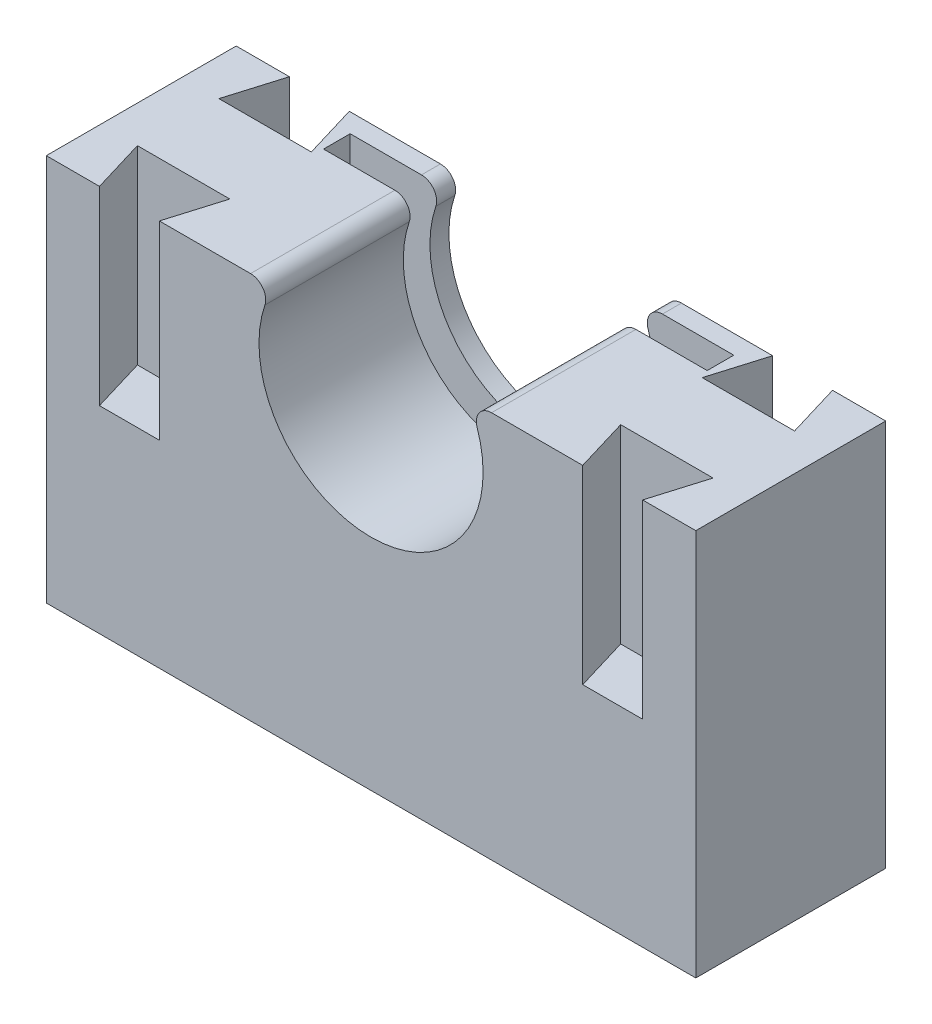
ISO-10303-21;
HEADER;
FILE_DESCRIPTION(('STEP AP214'),'2;1');
FILE_NAME('part.step','',(''),(''),'','','');
FILE_SCHEMA(('AUTOMOTIVE_DESIGN { 1 0 10303 214 1 1 1 1 }'));
ENDSEC;
DATA;
#1=APPLICATION_CONTEXT('core data for automotive mechanical design processes');
#2=APPLICATION_PROTOCOL_DEFINITION('international standard','automotive_design',2000,#1);
#3=PRODUCT_CONTEXT('',#1,'mechanical');
#4=PRODUCT('Part','Part','',(#3));
#5=PRODUCT_RELATED_PRODUCT_CATEGORY('part','',(#4));
#6=PRODUCT_DEFINITION_FORMATION('','',#4);
#7=PRODUCT_DEFINITION_CONTEXT('part definition',#1,'design');
#8=PRODUCT_DEFINITION('design','',#6,#7);
#9=PRODUCT_DEFINITION_SHAPE('','',#8);
#10=(LENGTH_UNIT() NAMED_UNIT(*) SI_UNIT(.MILLI.,.METRE.));
#11=(NAMED_UNIT(*) PLANE_ANGLE_UNIT() SI_UNIT($,.RADIAN.));
#12=(NAMED_UNIT(*) SI_UNIT($,.STERADIAN.) SOLID_ANGLE_UNIT());
#13=UNCERTAINTY_MEASURE_WITH_UNIT(LENGTH_MEASURE(1.E-05),#10,'distance_accuracy_value','');
#14=(GEOMETRIC_REPRESENTATION_CONTEXT(3) GLOBAL_UNCERTAINTY_ASSIGNED_CONTEXT((#13)) GLOBAL_UNIT_ASSIGNED_CONTEXT((#10,
#11,#12)) REPRESENTATION_CONTEXT('',''));
#15=CARTESIAN_POINT('',(0.,0.,0.));
#16=DIRECTION('',(0.,0.,1.));
#17=DIRECTION('',(1.,0.,0.));
#18=AXIS2_PLACEMENT_3D('',#15,#16,#17);
#19=CARTESIAN_POINT('',(27.0146670463276,26.0149253731343,25.));
#20=DIRECTION('',(0.,0.,-1.));
#21=DIRECTION('',(-1.,0.,0.));
#22=AXIS2_PLACEMENT_3D('',#19,#20,#21);
#23=CYLINDRICAL_SURFACE('',#22,2.);
#24=CARTESIAN_POINT('',(27.0146670463276,26.0149253731343,2.5));
#25=DIRECTION('',(0.,0.,1.));
#26=DIRECTION('',(1.,0.,0.));
#27=AXIS2_PLACEMENT_3D('',#24,#25,#26);
#28=CIRCLE('',#27,2.);
#29=CARTESIAN_POINT('',(27.0146670463276,28.0149253731343,2.5));
#30=VERTEX_POINT('',#29);
#31=CARTESIAN_POINT('',(25.1204378482512,25.3731343283582,2.5));
#32=VERTEX_POINT('',#31);
#33=EDGE_CURVE('E296',#30,#32,#28,.T.);
#34=ORIENTED_EDGE('',*,*,#33,.F.);
#35=DIRECTION('',(0.,0.,-1.));
#36=VECTOR('',#35,1.);
#37=CARTESIAN_POINT('',(27.0146670463276,28.0149253731343,25.));
#38=LINE('',#37,#36);
#39=CARTESIAN_POINT('',(27.0146670463276,28.0149253731343,0.));
#40=VERTEX_POINT('',#39);
#41=EDGE_CURVE('E549',#30,#40,#38,.T.);
#42=ORIENTED_EDGE('',*,*,#41,.T.);
#43=CARTESIAN_POINT('',(27.0146670463276,26.0149253731343,0.));
#44=DIRECTION('',(0.,0.,1.));
#45=DIRECTION('',(1.,0.,0.));
#46=AXIS2_PLACEMENT_3D('',#43,#44,#45);
#47=CIRCLE('',#46,2.);
#48=CARTESIAN_POINT('',(25.1204378482512,25.3731343283582,0.));
#49=VERTEX_POINT('',#48);
#50=EDGE_CURVE('E501',#40,#49,#47,.T.);
#51=ORIENTED_EDGE('',*,*,#50,.T.);
#52=DIRECTION('',(0.,0.,-1.));
#53=VECTOR('',#52,1.);
#54=CARTESIAN_POINT('',(25.1204378482512,25.3731343283582,25.));
#55=LINE('',#54,#53);
#56=EDGE_CURVE('E544',#32,#49,#55,.T.);
#57=ORIENTED_EDGE('',*,*,#56,.F.);
#58=EDGE_LOOP('',(#34,#42,#51,#57));
#59=FACE_BOUND('',#58,.T.);
#60=ADVANCED_FACE('F44',(#59),#23,.T.);
#61=CARTESIAN_POINT('',(11.1504975124378,20.6399253731341,25.));
#62=DIRECTION('',(0.,0.,-1.));
#63=DIRECTION('',(-1.,0.,0.));
#64=AXIS2_PLACEMENT_3D('',#61,#62,#63);
#65=CYLINDRICAL_SURFACE('',#64,14.75);
#66=CARTESIAN_POINT('',(11.1504975124378,20.6399253731341,2.5));
#67=DIRECTION('',(0.,0.,1.));
#68=DIRECTION('',(1.,0.,0.));
#69=AXIS2_PLACEMENT_3D('',#66,#67,#68);
#70=CIRCLE('',#69,14.75);
#71=CARTESIAN_POINT('',(-2.81944282337562,25.3731343283582,2.5));
#72=VERTEX_POINT('',#71);
#73=EDGE_CURVE('E60',#32,#72,#70,.F.);
#74=ORIENTED_EDGE('',*,*,#73,.F.);
#75=ORIENTED_EDGE('',*,*,#56,.T.);
#76=CARTESIAN_POINT('',(11.1504975124378,20.6399253731341,0.));
#77=DIRECTION('',(0.,0.,-1.));
#78=DIRECTION('',(1.,0.,0.));
#79=AXIS2_PLACEMENT_3D('',#76,#77,#78);
#80=CIRCLE('',#79,14.75);
#81=CARTESIAN_POINT('',(-2.81944282337562,25.3731343283582,0.));
#82=VERTEX_POINT('',#81);
#83=EDGE_CURVE('E505',#49,#82,#80,.T.);
#84=ORIENTED_EDGE('',*,*,#83,.T.);
#85=DIRECTION('',(0.,0.,-1.));
#86=VECTOR('',#85,1.);
#87=CARTESIAN_POINT('',(-2.81944282337562,25.3731343283582,25.));
#88=LINE('',#87,#86);
#89=EDGE_CURVE('E539',#72,#82,#88,.T.);
#90=ORIENTED_EDGE('',*,*,#89,.F.);
#91=EDGE_LOOP('',(#74,#75,#84,#90));
#92=FACE_BOUND('',#91,.T.);
#93=ADVANCED_FACE('F672',(#92),#65,.F.);
#94=CARTESIAN_POINT('',(-4.71367202145201,26.0149253731343,25.));
#95=DIRECTION('',(0.,0.,-1.));
#96=DIRECTION('',(-1.,0.,0.));
#97=AXIS2_PLACEMENT_3D('',#94,#95,#96);
#98=CYLINDRICAL_SURFACE('',#97,2.);
#99=CARTESIAN_POINT('',(-4.71367202145201,26.0149253731343,2.5));
#100=DIRECTION('',(0.,0.,1.));
#101=DIRECTION('',(1.,0.,0.));
#102=AXIS2_PLACEMENT_3D('',#99,#100,#101);
#103=CIRCLE('',#102,2.);
#104=CARTESIAN_POINT('',(-4.71367202145201,28.0149253731343,2.5));
#105=VERTEX_POINT('',#104);
#106=EDGE_CURVE('E53',#72,#105,#103,.T.);
#107=ORIENTED_EDGE('',*,*,#106,.F.);
#108=ORIENTED_EDGE('',*,*,#89,.T.);
#109=CARTESIAN_POINT('',(-4.71367202145201,26.0149253731343,0.));
#110=DIRECTION('',(0.,0.,1.));
#111=DIRECTION('',(-1.,0.,0.));
#112=AXIS2_PLACEMENT_3D('',#109,#110,#111);
#113=CIRCLE('',#112,2.);
#114=CARTESIAN_POINT('',(-4.71367202145201,28.0149253731343,0.));
#115=VERTEX_POINT('',#114);
#116=EDGE_CURVE('E509',#82,#115,#113,.T.);
#117=ORIENTED_EDGE('',*,*,#116,.T.);
#118=DIRECTION('',(0.,0.,-1.));
#119=VECTOR('',#118,1.);
#120=CARTESIAN_POINT('',(-4.71367202145201,28.0149253731343,25.));
#121=LINE('',#120,#119);
#122=EDGE_CURVE('E534',#105,#115,#121,.T.);
#123=ORIENTED_EDGE('',*,*,#122,.F.);
#124=EDGE_LOOP('',(#107,#108,#117,#123));
#125=FACE_BOUND('',#124,.T.);
#126=ADVANCED_FACE('F577',(#125),#98,.T.);
#127=CARTESIAN_POINT('',(53.9004975124378,28.0149253731343,25.));
#128=DIRECTION('',(0.,-1.,0.));
#129=DIRECTION('',(1.,0.,0.));
#130=AXIS2_PLACEMENT_3D('',#127,#128,#129);
#131=PLANE('',#130);
#132=DIRECTION('',(0.,0.,-1.));
#133=VECTOR('',#132,1.);
#134=CARTESIAN_POINT('',(36.4004975124378,28.0149253731343,6.));
#135=LINE('',#134,#133);
#136=CARTESIAN_POINT('',(36.4004975124378,28.0149253731343,6.));
#137=VERTEX_POINT('',#136);
#138=CARTESIAN_POINT('',(36.4004975124378,28.0149253731343,2.5));
#139=VERTEX_POINT('',#138);
#140=EDGE_CURVE('E272',#137,#139,#135,.T.);
#141=ORIENTED_EDGE('',*,*,#140,.F.);
#142=DIRECTION('',(1.,0.,0.));
#143=VECTOR('',#142,1.);
#144=CARTESIAN_POINT('',(36.4004975124378,28.0149253731343,6.));
#145=LINE('',#144,#143);
#146=CARTESIAN_POINT('',(27.0146670463276,28.0149253731343,6.));
#147=VERTEX_POINT('',#146);
#148=EDGE_CURVE('E254',#147,#137,#145,.T.);
#149=ORIENTED_EDGE('',*,*,#148,.F.);
#150=CARTESIAN_POINT('',(27.0146670463276,28.0149253731343,25.));
#151=VERTEX_POINT('',#150);
#152=EDGE_CURVE('E550',#151,#147,#38,.T.);
#153=ORIENTED_EDGE('',*,*,#152,.F.);
#154=DIRECTION('',(-1.,0.,0.));
#155=VECTOR('',#154,1.);
#156=CARTESIAN_POINT('',(53.9004975124378,28.0149253731343,25.));
#157=LINE('',#156,#155);
#158=CARTESIAN_POINT('',(39.0146670463276,28.0149253731343,25.));
#159=VERTEX_POINT('',#158);
#160=EDGE_CURVE('E467',#159,#151,#157,.T.);
#161=ORIENTED_EDGE('',*,*,#160,.F.);
#162=DIRECTION('',(-0.287193343911959,0.,-0.957872634128707));
#163=VECTOR('',#162,1.);
#164=CARTESIAN_POINT('',(39.0146670463276,28.0149253731343,25.));
#165=LINE('',#164,#163);
#166=CARTESIAN_POINT('',(36.8750766341835,28.0149253731343,17.8638488757411));
#167=VERTEX_POINT('',#166);
#168=EDGE_CURVE('E366',#159,#167,#165,.T.);
#169=ORIENTED_EDGE('',*,*,#168,.T.);
#170=DIRECTION('',(1.,0.,0.));
#171=VECTOR('',#170,1.);
#172=CARTESIAN_POINT('',(36.8750766341835,28.0149253731343,17.8638488757411));
#173=LINE('',#172,#171);
#174=CARTESIAN_POINT('',(49.0400879245819,28.0149253731343,17.8638488757411));
#175=VERTEX_POINT('',#174);
#176=EDGE_CURVE('E370',#167,#175,#173,.T.);
#177=ORIENTED_EDGE('',*,*,#176,.T.);
#178=DIRECTION('',(-0.287193343911958,0.,0.957872634128707));
#179=VECTOR('',#178,1.);
#180=CARTESIAN_POINT('',(49.0400879245819,28.0149253731343,17.8638488757411));
#181=LINE('',#180,#179);
#182=CARTESIAN_POINT('',(46.9004975124378,28.0149253731343,25.));
#183=VERTEX_POINT('',#182);
#184=EDGE_CURVE('E374',#175,#183,#181,.T.);
#185=ORIENTED_EDGE('',*,*,#184,.T.);
#186=CARTESIAN_POINT('',(53.9004975124378,28.0149253731343,25.));
#187=VERTEX_POINT('',#186);
#188=EDGE_CURVE('E469',#187,#183,#157,.T.);
#189=ORIENTED_EDGE('',*,*,#188,.F.);
#190=DIRECTION('',(0.,0.,-1.));
#191=VECTOR('',#190,1.);
#192=CARTESIAN_POINT('',(53.9004975124378,28.0149253731343,25.));
#193=LINE('',#192,#191);
#194=CARTESIAN_POINT('',(53.9004975124378,28.0149253731343,0.));
#195=VERTEX_POINT('',#194);
#196=EDGE_CURVE('E553',#187,#195,#193,.T.);
#197=ORIENTED_EDGE('',*,*,#196,.T.);
#198=DIRECTION('',(-1.,0.,0.));
#199=VECTOR('',#198,1.);
#200=CARTESIAN_POINT('',(53.9004975124378,28.0149253731343,0.));
#201=LINE('',#200,#199);
#202=CARTESIAN_POINT('',(46.9004975124378,28.0149253731343,0.));
#203=VERTEX_POINT('',#202);
#204=EDGE_CURVE('E497',#195,#203,#201,.T.);
#205=ORIENTED_EDGE('',*,*,#204,.T.);
#206=DIRECTION('',(0.287193343911966,0.,0.957872634128704));
#207=VECTOR('',#206,1.);
#208=CARTESIAN_POINT('',(46.9004975124378,28.0149253731343,0.));
#209=LINE('',#208,#207);
#210=CARTESIAN_POINT('',(49.040087924582,28.0149253731343,7.13615112425885));
#211=VERTEX_POINT('',#210);
#212=EDGE_CURVE('E378',#203,#211,#209,.T.);
#213=ORIENTED_EDGE('',*,*,#212,.T.);
#214=DIRECTION('',(-1.,0.,0.));
#215=VECTOR('',#214,1.);
#216=CARTESIAN_POINT('',(49.040087924582,28.0149253731343,7.13615112425885));
#217=LINE('',#216,#215);
#218=CARTESIAN_POINT('',(36.8750766341835,28.0149253731343,7.13615112425885));
#219=VERTEX_POINT('',#218);
#220=EDGE_CURVE('E382',#211,#219,#217,.T.);
#221=ORIENTED_EDGE('',*,*,#220,.T.);
#222=DIRECTION('',(0.287193343911964,0.,-0.957872634128705));
#223=VECTOR('',#222,1.);
#224=CARTESIAN_POINT('',(36.8750766341835,28.0149253731343,7.13615112425885));
#225=LINE('',#224,#223);
#226=CARTESIAN_POINT('',(39.0146670463276,28.0149253731343,0.));
#227=VERTEX_POINT('',#226);
#228=EDGE_CURVE('E386',#219,#227,#225,.T.);
#229=ORIENTED_EDGE('',*,*,#228,.T.);
#230=EDGE_CURVE('E496',#227,#40,#201,.T.);
#231=ORIENTED_EDGE('',*,*,#230,.T.);
#232=ORIENTED_EDGE('',*,*,#41,.F.);
#233=DIRECTION('',(1.,0.,0.));
#234=VECTOR('',#233,1.);
#235=CARTESIAN_POINT('',(36.4004975124378,28.0149253731343,2.5));
#236=LINE('',#235,#234);
#237=EDGE_CURVE('E282',#30,#139,#236,.T.);
#238=ORIENTED_EDGE('',*,*,#237,.T.);
#239=EDGE_LOOP('',(#141,#149,#153,#161,#169,#177,#185,#189,#197,#205,#213,#221,#229,#231,#232,#238));
#240=FACE_BOUND('',#239,.T.);
#241=ADVANCED_FACE('F280',(#240),#131,.F.);
#242=CARTESIAN_POINT('',(-4.71367202145201,28.0149253731343,25.));
#243=DIRECTION('',(0.,-1.,0.));
#244=DIRECTION('',(1.,0.,0.));
#245=AXIS2_PLACEMENT_3D('',#242,#243,#244);
#246=PLANE('',#245);
#247=CARTESIAN_POINT('',(-4.71367202145201,28.0149253731343,25.));
#248=VERTEX_POINT('',#247);
#249=CARTESIAN_POINT('',(-4.71367202145201,28.0149253731343,6.));
#250=VERTEX_POINT('',#249);
#251=EDGE_CURVE('E535',#248,#250,#121,.T.);
#252=ORIENTED_EDGE('',*,*,#251,.T.);
#253=CARTESIAN_POINT('',(-14.0995024875622,28.0149253731343,6.));
#254=VERTEX_POINT('',#253);
#255=EDGE_CURVE('E266',#254,#250,#145,.T.);
#256=ORIENTED_EDGE('',*,*,#255,.F.);
#257=DIRECTION('',(0.,0.,-1.));
#258=VECTOR('',#257,1.);
#259=CARTESIAN_POINT('',(-14.0995024875622,28.0149253731343,6.));
#260=LINE('',#259,#258);
#261=CARTESIAN_POINT('',(-14.0995024875622,28.0149253731343,2.5));
#262=VERTEX_POINT('',#261);
#263=EDGE_CURVE('E297',#254,#262,#260,.T.);
#264=ORIENTED_EDGE('',*,*,#263,.T.);
#265=EDGE_CURVE('E565',#262,#105,#236,.T.);
#266=ORIENTED_EDGE('',*,*,#265,.T.);
#267=ORIENTED_EDGE('',*,*,#122,.T.);
#268=DIRECTION('',(-1.,0.,0.));
#269=VECTOR('',#268,1.);
#270=CARTESIAN_POINT('',(-4.71367202145201,28.0149253731343,0.));
#271=LINE('',#270,#269);
#272=CARTESIAN_POINT('',(-16.713672021452,28.0149253731343,0.));
#273=VERTEX_POINT('',#272);
#274=EDGE_CURVE('E514',#115,#273,#271,.T.);
#275=ORIENTED_EDGE('',*,*,#274,.T.);
#276=DIRECTION('',(0.287115798996212,0.,0.95789588054588));
#277=VECTOR('',#276,1.);
#278=CARTESIAN_POINT('',(-14.5746593189302,28.0149253731343,7.13632431006681));
#279=LINE('',#278,#277);
#280=CARTESIAN_POINT('',(-14.5746593189302,28.0149253731343,7.13632431006681));
#281=VERTEX_POINT('',#280);
#282=EDGE_CURVE('E390',#273,#281,#279,.T.);
#283=ORIENTED_EDGE('',*,*,#282,.T.);
#284=DIRECTION('',(-1.,0.,0.));
#285=VECTOR('',#284,1.);
#286=CARTESIAN_POINT('',(-26.738515190084,28.0149253731343,7.13632431006681));
#287=LINE('',#286,#285);
#288=CARTESIAN_POINT('',(-26.738515190084,28.0149253731343,7.13632431006681));
#289=VERTEX_POINT('',#288);
#290=EDGE_CURVE('E394',#281,#289,#287,.T.);
#291=ORIENTED_EDGE('',*,*,#290,.T.);
#292=DIRECTION('',(0.287115798996211,0.,-0.95789588054588));
#293=VECTOR('',#292,1.);
#294=CARTESIAN_POINT('',(-24.5995024875622,28.0149253731343,0.));
#295=LINE('',#294,#293);
#296=CARTESIAN_POINT('',(-24.5995024875622,28.0149253731343,0.));
#297=VERTEX_POINT('',#296);
#298=EDGE_CURVE('E311',#289,#297,#295,.T.);
#299=ORIENTED_EDGE('',*,*,#298,.T.);
#300=CARTESIAN_POINT('',(-31.5995024875622,28.0149253731343,0.));
#301=VERTEX_POINT('',#300);
#302=EDGE_CURVE('E513',#297,#301,#271,.T.);
#303=ORIENTED_EDGE('',*,*,#302,.T.);
#304=DIRECTION('',(0.,0.,-1.));
#305=VECTOR('',#304,1.);
#306=CARTESIAN_POINT('',(-31.5995024875622,28.0149253731343,25.));
#307=LINE('',#306,#305);
#308=CARTESIAN_POINT('',(-31.5995024875622,28.0149253731343,25.));
#309=VERTEX_POINT('',#308);
#310=EDGE_CURVE('E530',#309,#301,#307,.T.);
#311=ORIENTED_EDGE('',*,*,#310,.F.);
#312=DIRECTION('',(-1.,0.,0.));
#313=VECTOR('',#312,1.);
#314=CARTESIAN_POINT('',(-4.71367202145201,28.0149253731343,25.));
#315=LINE('',#314,#313);
#316=CARTESIAN_POINT('',(-24.5995024875622,28.0149253731343,25.));
#317=VERTEX_POINT('',#316);
#318=EDGE_CURVE('E482',#317,#309,#315,.T.);
#319=ORIENTED_EDGE('',*,*,#318,.F.);
#320=DIRECTION('',(-0.28719334391196,0.,-0.957872634128706));
#321=VECTOR('',#320,1.);
#322=CARTESIAN_POINT('',(-24.5995024875622,28.0149253731343,25.));
#323=LINE('',#322,#321);
#324=CARTESIAN_POINT('',(-26.7390928997063,28.0149253731343,17.8638488757411));
#325=VERTEX_POINT('',#324);
#326=EDGE_CURVE('E68',#317,#325,#323,.T.);
#327=ORIENTED_EDGE('',*,*,#326,.T.);
#328=DIRECTION('',(1.,0.,0.));
#329=VECTOR('',#328,1.);
#330=CARTESIAN_POINT('',(-26.7390928997063,28.0149253731343,17.8638488757411));
#331=LINE('',#330,#329);
#332=CARTESIAN_POINT('',(-14.5740816093079,28.0149253731343,17.8638488757411));
#333=VERTEX_POINT('',#332);
#334=EDGE_CURVE('E358',#325,#333,#331,.T.);
#335=ORIENTED_EDGE('',*,*,#334,.T.);
#336=DIRECTION('',(-0.287193343911959,0.,0.957872634128707));
#337=VECTOR('',#336,1.);
#338=CARTESIAN_POINT('',(-14.5740816093079,28.0149253731343,17.8638488757411));
#339=LINE('',#338,#337);
#340=CARTESIAN_POINT('',(-16.713672021452,28.0149253731343,25.));
#341=VERTEX_POINT('',#340);
#342=EDGE_CURVE('E362',#333,#341,#339,.T.);
#343=ORIENTED_EDGE('',*,*,#342,.T.);
#344=EDGE_CURVE('E483',#248,#341,#315,.T.);
#345=ORIENTED_EDGE('',*,*,#344,.F.);
#346=EDGE_LOOP('',(#252,#256,#264,#266,#267,#275,#283,#291,#299,#303,#311,#319,#327,#335,#343,#345));
#347=FACE_BOUND('',#346,.T.);
#348=ADVANCED_FACE('F572',(#347),#246,.F.);
#349=CARTESIAN_POINT('',(-4.71367202145201,26.0149253731343,25.));
#350=DIRECTION('',(0.,0.,-1.));
#351=DIRECTION('',(-1.,0.,0.));
#352=AXIS2_PLACEMENT_3D('',#349,#350,#351);
#353=PLANE('',#352);
#354=DIRECTION('',(0.,1.,0.));
#355=VECTOR('',#354,1.);
#356=CARTESIAN_POINT('',(46.9004975124378,3.01492537313434,25.));
#357=LINE('',#356,#355);
#358=CARTESIAN_POINT('',(46.9004975124378,3.01492537313434,25.));
#359=VERTEX_POINT('',#358);
#360=EDGE_CURVE('E428',#359,#183,#357,.T.);
#361=ORIENTED_EDGE('',*,*,#360,.F.);
#362=DIRECTION('',(1.,0.,0.));
#363=VECTOR('',#362,1.);
#364=CARTESIAN_POINT('',(-4.71367202145201,3.01492537313433,25.));
#365=LINE('',#364,#363);
#366=CARTESIAN_POINT('',(39.0146670463276,3.01492537313434,25.));
#367=VERTEX_POINT('',#366);
#368=EDGE_CURVE('E404',#367,#359,#365,.T.);
#369=ORIENTED_EDGE('',*,*,#368,.F.);
#370=DIRECTION('',(0.,1.,0.));
#371=VECTOR('',#370,1.);
#372=CARTESIAN_POINT('',(39.0146670463276,3.01492537313434,25.));
#373=LINE('',#372,#371);
#374=EDGE_CURVE('E437',#367,#159,#373,.T.);
#375=ORIENTED_EDGE('',*,*,#374,.T.);
#376=ORIENTED_EDGE('',*,*,#160,.T.);
#377=CARTESIAN_POINT('',(27.0146670463276,26.0149253731343,25.));
#378=DIRECTION('',(0.,0.,1.));
#379=DIRECTION('',(1.,0.,0.));
#380=AXIS2_PLACEMENT_3D('',#377,#378,#379);
#381=CIRCLE('',#380,2.);
#382=CARTESIAN_POINT('',(25.1204378482512,25.3731343283582,25.));
#383=VERTEX_POINT('',#382);
#384=EDGE_CURVE('E473',#151,#383,#381,.T.);
#385=ORIENTED_EDGE('',*,*,#384,.T.);
#386=CARTESIAN_POINT('',(11.1504975124378,20.6399253731341,25.));
#387=DIRECTION('',(0.,0.,-1.));
#388=DIRECTION('',(1.,0.,0.));
#389=AXIS2_PLACEMENT_3D('',#386,#387,#388);
#390=CIRCLE('',#389,14.75);
#391=CARTESIAN_POINT('',(-2.81944282337562,25.3731343283582,25.));
#392=VERTEX_POINT('',#391);
#393=EDGE_CURVE('E476',#383,#392,#390,.T.);
#394=ORIENTED_EDGE('',*,*,#393,.T.);
#395=CARTESIAN_POINT('',(-4.71367202145201,26.0149253731343,25.));
#396=DIRECTION('',(0.,0.,1.));
#397=DIRECTION('',(-1.,0.,0.));
#398=AXIS2_PLACEMENT_3D('',#395,#396,#397);
#399=CIRCLE('',#398,2.);
#400=EDGE_CURVE('E479',#392,#248,#399,.T.);
#401=ORIENTED_EDGE('',*,*,#400,.T.);
#402=ORIENTED_EDGE('',*,*,#344,.T.);
#403=DIRECTION('',(0.,1.,0.));
#404=VECTOR('',#403,1.);
#405=CARTESIAN_POINT('',(-16.713672021452,3.01492537313433,25.));
#406=LINE('',#405,#404);
#407=CARTESIAN_POINT('',(-16.713672021452,3.01492537313433,25.));
#408=VERTEX_POINT('',#407);
#409=EDGE_CURVE('E441',#408,#341,#406,.T.);
#410=ORIENTED_EDGE('',*,*,#409,.F.);
#411=CARTESIAN_POINT('',(-24.5995024875622,3.01492537313433,25.));
#412=VERTEX_POINT('',#411);
#413=EDGE_CURVE('E454',#412,#408,#365,.T.);
#414=ORIENTED_EDGE('',*,*,#413,.F.);
#415=DIRECTION('',(0.,1.,0.));
#416=VECTOR('',#415,1.);
#417=CARTESIAN_POINT('',(-24.5995024875622,3.01492537313433,25.));
#418=LINE('',#417,#416);
#419=EDGE_CURVE('E355',#412,#317,#418,.T.);
#420=ORIENTED_EDGE('',*,*,#419,.T.);
#421=ORIENTED_EDGE('',*,*,#318,.T.);
#422=DIRECTION('',(0.,-1.,0.));
#423=VECTOR('',#422,1.);
#424=CARTESIAN_POINT('',(-31.5995024875622,28.0149253731343,25.));
#425=LINE('',#424,#423);
#426=CARTESIAN_POINT('',(-31.5995024875622,-22.9850746268657,25.));
#427=VERTEX_POINT('',#426);
#428=EDGE_CURVE('E487',#309,#427,#425,.T.);
#429=ORIENTED_EDGE('',*,*,#428,.T.);
#430=DIRECTION('',(1.,0.,0.));
#431=VECTOR('',#430,1.);
#432=CARTESIAN_POINT('',(53.9004975124378,-22.9850746268657,25.));
#433=LINE('',#432,#431);
#434=CARTESIAN_POINT('',(53.9004975124378,-22.9850746268657,25.));
#435=VERTEX_POINT('',#434);
#436=EDGE_CURVE('E490',#427,#435,#433,.T.);
#437=ORIENTED_EDGE('',*,*,#436,.T.);
#438=DIRECTION('',(0.,1.,0.));
#439=VECTOR('',#438,1.);
#440=CARTESIAN_POINT('',(53.9004975124378,28.0149253731343,25.));
#441=LINE('',#440,#439);
#442=EDGE_CURVE('E464',#435,#187,#441,.T.);
#443=ORIENTED_EDGE('',*,*,#442,.T.);
#444=ORIENTED_EDGE('',*,*,#188,.T.);
#445=EDGE_LOOP('',(#361,#369,#375,#376,#385,#394,#401,#402,#410,#414,#420,#421,#429,#437,#443,#444));
#446=FACE_BOUND('',#445,.T.);
#447=ADVANCED_FACE('F614',(#446),#353,.F.);
#448=CARTESIAN_POINT('',(53.9004975124378,28.0149253731343,25.));
#449=DIRECTION('',(-1.,0.,0.));
#450=DIRECTION('',(0.,0.,1.));
#451=AXIS2_PLACEMENT_3D('',#448,#449,#450);
#452=PLANE('',#451);
#453=ORIENTED_EDGE('',*,*,#196,.F.);
#454=ORIENTED_EDGE('',*,*,#442,.F.);
#455=DIRECTION('',(0.,0.,-1.));
#456=VECTOR('',#455,1.);
#457=CARTESIAN_POINT('',(53.9004975124378,-22.9850746268657,25.));
#458=LINE('',#457,#456);
#459=CARTESIAN_POINT('',(53.9004975124378,-22.9850746268657,0.));
#460=VERTEX_POINT('',#459);
#461=EDGE_CURVE('E493',#435,#460,#458,.T.);
#462=ORIENTED_EDGE('',*,*,#461,.T.);
#463=DIRECTION('',(0.,1.,0.));
#464=VECTOR('',#463,1.);
#465=CARTESIAN_POINT('',(53.9004975124378,28.0149253731343,0.));
#466=LINE('',#465,#464);
#467=EDGE_CURVE('E459',#460,#195,#466,.T.);
#468=ORIENTED_EDGE('',*,*,#467,.T.);
#469=EDGE_LOOP('',(#453,#454,#462,#468));
#470=FACE_BOUND('',#469,.T.);
#471=ADVANCED_FACE('F46',(#470),#452,.F.);
#472=ORIENTED_EDGE('',*,*,#152,.T.);
#473=CARTESIAN_POINT('',(27.0146670463276,26.0149253731343,6.));
#474=DIRECTION('',(0.,0.,1.));
#475=DIRECTION('',(1.,0.,0.));
#476=AXIS2_PLACEMENT_3D('',#473,#474,#475);
#477=CIRCLE('',#476,2.);
#478=CARTESIAN_POINT('',(25.1204378482512,25.3731343283582,6.));
#479=VERTEX_POINT('',#478);
#480=EDGE_CURVE('E260',#147,#479,#477,.T.);
#481=ORIENTED_EDGE('',*,*,#480,.T.);
#482=EDGE_CURVE('E545',#383,#479,#55,.T.);
#483=ORIENTED_EDGE('',*,*,#482,.F.);
#484=ORIENTED_EDGE('',*,*,#384,.F.);
#485=EDGE_LOOP('',(#472,#481,#483,#484));
#486=FACE_BOUND('',#485,.T.);
#487=ADVANCED_FACE('F622',(#486),#23,.T.);
#488=ORIENTED_EDGE('',*,*,#482,.T.);
#489=CARTESIAN_POINT('',(11.1504975124378,20.6399253731341,6.));
#490=DIRECTION('',(0.,0.,1.));
#491=DIRECTION('',(1.,0.,0.));
#492=AXIS2_PLACEMENT_3D('',#489,#490,#491);
#493=CIRCLE('',#492,14.75);
#494=CARTESIAN_POINT('',(-2.81944282337562,25.3731343283582,6.));
#495=VERTEX_POINT('',#494);
#496=EDGE_CURVE('E300',#479,#495,#493,.F.);
#497=ORIENTED_EDGE('',*,*,#496,.T.);
#498=EDGE_CURVE('E540',#392,#495,#88,.T.);
#499=ORIENTED_EDGE('',*,*,#498,.F.);
#500=ORIENTED_EDGE('',*,*,#393,.F.);
#501=EDGE_LOOP('',(#488,#497,#499,#500));
#502=FACE_BOUND('',#501,.T.);
#503=ADVANCED_FACE('F620',(#502),#65,.F.);
#504=ORIENTED_EDGE('',*,*,#498,.T.);
#505=CARTESIAN_POINT('',(-4.71367202145201,26.0149253731343,6.));
#506=DIRECTION('',(0.,0.,1.));
#507=DIRECTION('',(1.,0.,0.));
#508=AXIS2_PLACEMENT_3D('',#505,#506,#507);
#509=CIRCLE('',#508,2.);
#510=EDGE_CURVE('E12',#495,#250,#509,.T.);
#511=ORIENTED_EDGE('',*,*,#510,.T.);
#512=ORIENTED_EDGE('',*,*,#251,.F.);
#513=ORIENTED_EDGE('',*,*,#400,.F.);
#514=EDGE_LOOP('',(#504,#511,#512,#513));
#515=FACE_BOUND('',#514,.T.);
#516=ADVANCED_FACE('F606',(#515),#98,.T.);
#517=CARTESIAN_POINT('',(-31.5995024875622,28.0149253731343,25.));
#518=DIRECTION('',(1.,0.,0.));
#519=DIRECTION('',(0.,0.,-1.));
#520=AXIS2_PLACEMENT_3D('',#517,#518,#519);
#521=PLANE('',#520);
#522=DIRECTION('',(0.,-1.,0.));
#523=VECTOR('',#522,1.);
#524=CARTESIAN_POINT('',(-31.5995024875622,28.0149253731343,0.));
#525=LINE('',#524,#523);
#526=CARTESIAN_POINT('',(-31.5995024875622,-22.9850746268657,0.));
#527=VERTEX_POINT('',#526);
#528=EDGE_CURVE('E518',#301,#527,#525,.T.);
#529=ORIENTED_EDGE('',*,*,#528,.T.);
#530=DIRECTION('',(0.,0.,-1.));
#531=VECTOR('',#530,1.);
#532=CARTESIAN_POINT('',(-31.5995024875622,-22.9850746268657,25.));
#533=LINE('',#532,#531);
#534=EDGE_CURVE('E526',#427,#527,#533,.T.);
#535=ORIENTED_EDGE('',*,*,#534,.F.);
#536=ORIENTED_EDGE('',*,*,#428,.F.);
#537=ORIENTED_EDGE('',*,*,#310,.T.);
#538=EDGE_LOOP('',(#529,#535,#536,#537));
#539=FACE_BOUND('',#538,.T.);
#540=ADVANCED_FACE('F690',(#539),#521,.F.);
#541=CARTESIAN_POINT('',(53.9004975124378,-22.9850746268657,25.));
#542=DIRECTION('',(0.,1.,0.));
#543=DIRECTION('',(0.,0.,1.));
#544=AXIS2_PLACEMENT_3D('',#541,#542,#543);
#545=PLANE('',#544);
#546=DIRECTION('',(1.,0.,0.));
#547=VECTOR('',#546,1.);
#548=CARTESIAN_POINT('',(53.9004975124378,-22.9850746268657,0.));
#549=LINE('',#548,#547);
#550=EDGE_CURVE('E468',#527,#460,#549,.T.);
#551=ORIENTED_EDGE('',*,*,#550,.T.);
#552=ORIENTED_EDGE('',*,*,#461,.F.);
#553=ORIENTED_EDGE('',*,*,#436,.F.);
#554=ORIENTED_EDGE('',*,*,#534,.T.);
#555=EDGE_LOOP('',(#551,#552,#553,#554));
#556=FACE_BOUND('',#555,.T.);
#557=ADVANCED_FACE('F693',(#556),#545,.F.);
#558=CARTESIAN_POINT('',(-4.71367202145201,26.0149253731343,0.));
#559=DIRECTION('',(0.,0.,-1.));
#560=DIRECTION('',(-1.,0.,0.));
#561=AXIS2_PLACEMENT_3D('',#558,#559,#560);
#562=PLANE('',#561);
#563=ORIENTED_EDGE('',*,*,#204,.F.);
#564=ORIENTED_EDGE('',*,*,#467,.F.);
#565=ORIENTED_EDGE('',*,*,#550,.F.);
#566=ORIENTED_EDGE('',*,*,#528,.F.);
#567=ORIENTED_EDGE('',*,*,#302,.F.);
#568=DIRECTION('',(0.,1.,0.));
#569=VECTOR('',#568,1.);
#570=CARTESIAN_POINT('',(-24.5995024875622,3.01492537313433,0.));
#571=LINE('',#570,#569);
#572=CARTESIAN_POINT('',(-24.5995024875622,3.01492537313433,0.));
#573=VERTEX_POINT('',#572);
#574=EDGE_CURVE('E401',#573,#297,#571,.T.);
#575=ORIENTED_EDGE('',*,*,#574,.F.);
#576=DIRECTION('',(1.,0.,0.));
#577=VECTOR('',#576,1.);
#578=CARTESIAN_POINT('',(-4.71367202145201,3.01492537313433,0.));
#579=LINE('',#578,#577);
#580=CARTESIAN_POINT('',(-16.713672021452,3.01492537313433,0.));
#581=VERTEX_POINT('',#580);
#582=EDGE_CURVE('E558',#573,#581,#579,.T.);
#583=ORIENTED_EDGE('',*,*,#582,.T.);
#584=DIRECTION('',(0.,1.,0.));
#585=VECTOR('',#584,1.);
#586=CARTESIAN_POINT('',(-16.713672021452,3.01492537313433,0.));
#587=LINE('',#586,#585);
#588=EDGE_CURVE('E411',#581,#273,#587,.T.);
#589=ORIENTED_EDGE('',*,*,#588,.T.);
#590=ORIENTED_EDGE('',*,*,#274,.F.);
#591=ORIENTED_EDGE('',*,*,#116,.F.);
#592=ORIENTED_EDGE('',*,*,#83,.F.);
#593=ORIENTED_EDGE('',*,*,#50,.F.);
#594=ORIENTED_EDGE('',*,*,#230,.F.);
#595=DIRECTION('',(0.,1.,0.));
#596=VECTOR('',#595,1.);
#597=CARTESIAN_POINT('',(39.0146670463276,3.01492537313434,0.));
#598=LINE('',#597,#596);
#599=CARTESIAN_POINT('',(39.0146670463276,3.01492537313434,0.));
#600=VERTEX_POINT('',#599);
#601=EDGE_CURVE('E415',#600,#227,#598,.T.);
#602=ORIENTED_EDGE('',*,*,#601,.F.);
#603=CARTESIAN_POINT('',(46.9004975124378,3.01492537313434,0.));
#604=VERTEX_POINT('',#603);
#605=EDGE_CURVE('E557',#600,#604,#579,.T.);
#606=ORIENTED_EDGE('',*,*,#605,.T.);
#607=DIRECTION('',(0.,1.,0.));
#608=VECTOR('',#607,1.);
#609=CARTESIAN_POINT('',(46.9004975124378,3.01492537313434,0.));
#610=LINE('',#609,#608);
#611=EDGE_CURVE('E424',#604,#203,#610,.T.);
#612=ORIENTED_EDGE('',*,*,#611,.T.);
#613=EDGE_LOOP('',(#563,#564,#565,#566,#567,#575,#583,#589,#590,#591,#592,#593,#594,#602,#606,#612));
#614=FACE_BOUND('',#613,.T.);
#615=CARTESIAN_POINT('',(11.1504975124378,-2.91007462686588,0.));
#616=DIRECTION('',(0.,0.,-1.));
#617=DIRECTION('',(-1.,0.,0.));
#618=AXIS2_PLACEMENT_3D('',#615,#616,#617);
#619=CIRCLE('',#618,4.4);
#620=CARTESIAN_POINT('',(6.75049751243781,-2.91007462686588,0.));
#621=VERTEX_POINT('',#620);
#622=EDGE_CURVE('E460',#621,#621,#619,.T.);
#623=ORIENTED_EDGE('',*,*,#622,.F.);
#624=EDGE_LOOP('',(#623));
#625=FACE_BOUND('',#624,.T.);
#626=ADVANCED_FACE('F646',(#614,#625),#562,.T.);
#627=CARTESIAN_POINT('',(11.1504975124378,-2.91007462686588,4.5));
#628=DIRECTION('',(0.,0.,-1.));
#629=DIRECTION('',(-1.,0.,0.));
#630=AXIS2_PLACEMENT_3D('',#627,#628,#629);
#631=CYLINDRICAL_SURFACE('',#630,4.4);
#632=CARTESIAN_POINT('',(11.1504975124378,-2.91007462686588,4.5));
#633=DIRECTION('',(0.,0.,-1.));
#634=DIRECTION('',(-1.,0.,0.));
#635=AXIS2_PLACEMENT_3D('',#632,#633,#634);
#636=CIRCLE('',#635,4.4);
#637=CARTESIAN_POINT('',(6.75049751243781,-2.91007462686588,4.5));
#638=VERTEX_POINT('',#637);
#639=EDGE_CURVE('E455',#638,#638,#636,.T.);
#640=ORIENTED_EDGE('',*,*,#639,.F.);
#641=EDGE_LOOP('',(#640));
#642=FACE_BOUND('',#641,.T.);
#643=ORIENTED_EDGE('',*,*,#622,.T.);
#644=EDGE_LOOP('',(#643));
#645=FACE_BOUND('',#644,.T.);
#646=ADVANCED_FACE('F700',(#642,#645),#631,.F.);
#647=CARTESIAN_POINT('',(11.1504975124378,-2.91007462686588,4.5));
#648=DIRECTION('',(0.,0.,-1.));
#649=DIRECTION('',(-1.,0.,0.));
#650=AXIS2_PLACEMENT_3D('',#647,#648,#649);
#651=PLANE('',#650);
#652=ORIENTED_EDGE('',*,*,#639,.T.);
#653=EDGE_LOOP('',(#652));
#654=FACE_BOUND('',#653,.T.);
#655=ADVANCED_FACE('F725',(#654),#651,.T.);
#656=CARTESIAN_POINT('',(46.9004975124378,3.01492537313434,0.));
#657=DIRECTION('',(-0.957872634128705,0.,0.287193343911966));
#658=DIRECTION('',(0.287193343911966,0.,0.957872634128705));
#659=AXIS2_PLACEMENT_3D('',#656,#657,#658);
#660=PLANE('',#659);
#661=ORIENTED_EDGE('',*,*,#212,.F.);
#662=ORIENTED_EDGE('',*,*,#611,.F.);
#663=DIRECTION('',(0.287193343911966,0.,0.957872634128704));
#664=VECTOR('',#663,1.);
#665=CARTESIAN_POINT('',(46.9004975124378,3.01492537313434,0.));
#666=LINE('',#665,#664);
#667=CARTESIAN_POINT('',(49.040087924582,3.01492537313434,7.13615112425885));
#668=VERTEX_POINT('',#667);
#669=EDGE_CURVE('E331',#604,#668,#666,.T.);
#670=ORIENTED_EDGE('',*,*,#669,.T.);
#671=DIRECTION('',(0.,1.,0.));
#672=VECTOR('',#671,1.);
#673=CARTESIAN_POINT('',(49.040087924582,3.01492537313434,7.13615112425885));
#674=LINE('',#673,#672);
#675=EDGE_CURVE('E421',#668,#211,#674,.T.);
#676=ORIENTED_EDGE('',*,*,#675,.T.);
#677=EDGE_LOOP('',(#661,#662,#670,#676));
#678=FACE_BOUND('',#677,.T.);
#679=ADVANCED_FACE('F653',(#678),#660,.T.);
#680=CARTESIAN_POINT('',(36.8750766341835,3.01492537313433,7.13615112425885));
#681=DIRECTION('',(0.957872634128705,0.,0.287193343911964));
#682=DIRECTION('',(0.287193343911965,0.,-0.957872634128705));
#683=AXIS2_PLACEMENT_3D('',#680,#681,#682);
#684=PLANE('',#683);
#685=ORIENTED_EDGE('',*,*,#228,.F.);
#686=DIRECTION('',(0.,1.,0.));
#687=VECTOR('',#686,1.);
#688=CARTESIAN_POINT('',(36.8750766341835,3.01492537313433,7.13615112425885));
#689=LINE('',#688,#687);
#690=CARTESIAN_POINT('',(36.8750766341835,3.01492537313433,7.13615112425885));
#691=VERTEX_POINT('',#690);
#692=EDGE_CURVE('E418',#691,#219,#689,.T.);
#693=ORIENTED_EDGE('',*,*,#692,.F.);
#694=DIRECTION('',(0.287193343911964,0.,-0.957872634128705));
#695=VECTOR('',#694,1.);
#696=CARTESIAN_POINT('',(36.8750766341835,3.01492537313433,7.13615112425885));
#697=LINE('',#696,#695);
#698=EDGE_CURVE('E339',#691,#600,#697,.T.);
#699=ORIENTED_EDGE('',*,*,#698,.T.);
#700=ORIENTED_EDGE('',*,*,#601,.T.);
#701=EDGE_LOOP('',(#685,#693,#699,#700));
#702=FACE_BOUND('',#701,.T.);
#703=ADVANCED_FACE('F732',(#702),#684,.T.);
#704=CARTESIAN_POINT('',(11.1504975124378,3.01492537313433,12.5));
#705=DIRECTION('',(0.,1.,0.));
#706=DIRECTION('',(-1.,0.,0.));
#707=AXIS2_PLACEMENT_3D('',#704,#705,#706);
#708=PLANE('',#707);
#709=ORIENTED_EDGE('',*,*,#698,.F.);
#710=DIRECTION('',(-1.,0.,0.));
#711=VECTOR('',#710,1.);
#712=CARTESIAN_POINT('',(49.040087924582,3.01492537313434,7.13615112425885));
#713=LINE('',#712,#711);
#714=EDGE_CURVE('E335',#668,#691,#713,.T.);
#715=ORIENTED_EDGE('',*,*,#714,.F.);
#716=ORIENTED_EDGE('',*,*,#669,.F.);
#717=ORIENTED_EDGE('',*,*,#605,.F.);
#718=EDGE_LOOP('',(#709,#715,#716,#717));
#719=FACE_BOUND('',#718,.T.);
#720=ADVANCED_FACE('F657',(#719),#708,.T.);
#721=CARTESIAN_POINT('',(49.040087924582,3.01492537313434,7.13615112425885));
#722=DIRECTION('',(0.,0.,-1.));
#723=DIRECTION('',(-1.,0.,0.));
#724=AXIS2_PLACEMENT_3D('',#721,#722,#723);
#725=PLANE('',#724);
#726=ORIENTED_EDGE('',*,*,#220,.F.);
#727=ORIENTED_EDGE('',*,*,#675,.F.);
#728=ORIENTED_EDGE('',*,*,#714,.T.);
#729=ORIENTED_EDGE('',*,*,#692,.T.);
#730=EDGE_LOOP('',(#726,#727,#728,#729));
#731=FACE_BOUND('',#730,.T.);
#732=ADVANCED_FACE('F660',(#731),#725,.T.);
#733=CARTESIAN_POINT('',(-14.5746593189302,3.01492537313433,7.13632431006681));
#734=DIRECTION('',(-0.95789588054588,0.,0.287115798996212));
#735=DIRECTION('',(0.287115798996212,0.,0.95789588054588));
#736=AXIS2_PLACEMENT_3D('',#733,#734,#735);
#737=PLANE('',#736);
#738=ORIENTED_EDGE('',*,*,#282,.F.);
#739=ORIENTED_EDGE('',*,*,#588,.F.);
#740=DIRECTION('',(0.287115798996212,0.,0.95789588054588));
#741=VECTOR('',#740,1.);
#742=CARTESIAN_POINT('',(-14.5746593189302,3.01492537313433,7.13632431006681));
#743=LINE('',#742,#741);
#744=CARTESIAN_POINT('',(-14.5746593189302,3.01492537313433,7.13632431006681));
#745=VERTEX_POINT('',#744);
#746=EDGE_CURVE('E343',#581,#745,#743,.T.);
#747=ORIENTED_EDGE('',*,*,#746,.T.);
#748=DIRECTION('',(0.,1.,0.));
#749=VECTOR('',#748,1.);
#750=CARTESIAN_POINT('',(-14.5746593189302,3.01492537313433,7.13632431006681));
#751=LINE('',#750,#749);
#752=EDGE_CURVE('E408',#745,#281,#751,.T.);
#753=ORIENTED_EDGE('',*,*,#752,.T.);
#754=EDGE_LOOP('',(#738,#739,#747,#753));
#755=FACE_BOUND('',#754,.T.);
#756=ADVANCED_FACE('F675',(#755),#737,.T.);
#757=CARTESIAN_POINT('',(-24.5995024875622,3.01492537313433,0.));
#758=DIRECTION('',(0.95789588054588,0.,0.287115798996211));
#759=DIRECTION('',(0.287115798996211,0.,-0.95789588054588));
#760=AXIS2_PLACEMENT_3D('',#757,#758,#759);
#761=PLANE('',#760);
#762=ORIENTED_EDGE('',*,*,#298,.F.);
#763=DIRECTION('',(0.,1.,0.));
#764=VECTOR('',#763,1.);
#765=CARTESIAN_POINT('',(-26.738515190084,3.01492537313433,7.13632431006681));
#766=LINE('',#765,#764);
#767=CARTESIAN_POINT('',(-26.738515190084,3.01492537313433,7.13632431006681));
#768=VERTEX_POINT('',#767);
#769=EDGE_CURVE('E405',#768,#289,#766,.T.);
#770=ORIENTED_EDGE('',*,*,#769,.F.);
#771=DIRECTION('',(0.287115798996211,0.,-0.95789588054588));
#772=VECTOR('',#771,1.);
#773=CARTESIAN_POINT('',(-24.5995024875622,3.01492537313433,0.));
#774=LINE('',#773,#772);
#775=EDGE_CURVE('E351',#768,#573,#774,.T.);
#776=ORIENTED_EDGE('',*,*,#775,.T.);
#777=ORIENTED_EDGE('',*,*,#574,.T.);
#778=EDGE_LOOP('',(#762,#770,#776,#777));
#779=FACE_BOUND('',#778,.T.);
#780=ADVANCED_FACE('F683',(#779),#761,.T.);
#781=ORIENTED_EDGE('',*,*,#775,.F.);
#782=DIRECTION('',(-1.,0.,0.));
#783=VECTOR('',#782,1.);
#784=CARTESIAN_POINT('',(-26.738515190084,3.01492537313433,7.13632431006681));
#785=LINE('',#784,#783);
#786=EDGE_CURVE('E347',#745,#768,#785,.T.);
#787=ORIENTED_EDGE('',*,*,#786,.F.);
#788=ORIENTED_EDGE('',*,*,#746,.F.);
#789=ORIENTED_EDGE('',*,*,#582,.F.);
#790=EDGE_LOOP('',(#781,#787,#788,#789));
#791=FACE_BOUND('',#790,.T.);
#792=ADVANCED_FACE('F734',(#791),#708,.T.);
#793=CARTESIAN_POINT('',(-26.738515190084,3.01492537313433,7.13632431006681));
#794=DIRECTION('',(0.,0.,-1.));
#795=DIRECTION('',(-1.,0.,0.));
#796=AXIS2_PLACEMENT_3D('',#793,#794,#795);
#797=PLANE('',#796);
#798=ORIENTED_EDGE('',*,*,#290,.F.);
#799=ORIENTED_EDGE('',*,*,#752,.F.);
#800=ORIENTED_EDGE('',*,*,#786,.T.);
#801=ORIENTED_EDGE('',*,*,#769,.T.);
#802=EDGE_LOOP('',(#798,#799,#800,#801));
#803=FACE_BOUND('',#802,.T.);
#804=ADVANCED_FACE('F679',(#803),#797,.T.);
#805=CARTESIAN_POINT('',(-14.5740816093079,3.01492537313433,17.8638488757411));
#806=DIRECTION('',(-0.957872634128707,0.,-0.287193343911959));
#807=DIRECTION('',(-0.287193343911959,0.,0.957872634128707));
#808=AXIS2_PLACEMENT_3D('',#805,#806,#807);
#809=PLANE('',#808);
#810=ORIENTED_EDGE('',*,*,#342,.F.);
#811=DIRECTION('',(0.,1.,0.));
#812=VECTOR('',#811,1.);
#813=CARTESIAN_POINT('',(-14.5740816093079,3.01492537313433,17.8638488757411));
#814=LINE('',#813,#812);
#815=CARTESIAN_POINT('',(-14.5740816093079,3.01492537313433,17.8638488757411));
#816=VERTEX_POINT('',#815);
#817=EDGE_CURVE('E444',#816,#333,#814,.T.);
#818=ORIENTED_EDGE('',*,*,#817,.F.);
#819=DIRECTION('',(-0.287193343911959,0.,0.957872634128707));
#820=VECTOR('',#819,1.);
#821=CARTESIAN_POINT('',(-14.5740816093079,3.01492537313433,17.8638488757411));
#822=LINE('',#821,#820);
#823=EDGE_CURVE('E315',#816,#408,#822,.T.);
#824=ORIENTED_EDGE('',*,*,#823,.T.);
#825=ORIENTED_EDGE('',*,*,#409,.T.);
#826=EDGE_LOOP('',(#810,#818,#824,#825));
#827=FACE_BOUND('',#826,.T.);
#828=ADVANCED_FACE('F738',(#827),#809,.T.);
#829=CARTESIAN_POINT('',(-24.5995024875622,3.01492537313433,25.));
#830=DIRECTION('',(0.957872634128706,0.,-0.28719334391196));
#831=DIRECTION('',(-0.28719334391196,0.,-0.957872634128707));
#832=AXIS2_PLACEMENT_3D('',#829,#830,#831);
#833=PLANE('',#832);
#834=ORIENTED_EDGE('',*,*,#326,.F.);
#835=ORIENTED_EDGE('',*,*,#419,.F.);
#836=DIRECTION('',(-0.28719334391196,0.,-0.957872634128706));
#837=VECTOR('',#836,1.);
#838=CARTESIAN_POINT('',(-24.5995024875622,3.01492537313433,25.));
#839=LINE('',#838,#837);
#840=CARTESIAN_POINT('',(-26.7390928997063,3.01492537313433,17.8638488757411));
#841=VERTEX_POINT('',#840);
#842=EDGE_CURVE('E306',#412,#841,#839,.T.);
#843=ORIENTED_EDGE('',*,*,#842,.T.);
#844=DIRECTION('',(0.,1.,0.));
#845=VECTOR('',#844,1.);
#846=CARTESIAN_POINT('',(-26.7390928997063,3.01492537313433,17.8638488757411));
#847=LINE('',#846,#845);
#848=EDGE_CURVE('E447',#841,#325,#847,.T.);
#849=ORIENTED_EDGE('',*,*,#848,.T.);
#850=EDGE_LOOP('',(#834,#835,#843,#849));
#851=FACE_BOUND('',#850,.T.);
#852=ADVANCED_FACE('F735',(#851),#833,.T.);
#853=ORIENTED_EDGE('',*,*,#413,.T.);
#854=ORIENTED_EDGE('',*,*,#823,.F.);
#855=DIRECTION('',(1.,0.,0.));
#856=VECTOR('',#855,1.);
#857=CARTESIAN_POINT('',(-26.7390928997063,3.01492537313433,17.8638488757411));
#858=LINE('',#857,#856);
#859=EDGE_CURVE('E310',#841,#816,#858,.T.);
#860=ORIENTED_EDGE('',*,*,#859,.F.);
#861=ORIENTED_EDGE('',*,*,#842,.F.);
#862=EDGE_LOOP('',(#853,#854,#860,#861));
#863=FACE_BOUND('',#862,.T.);
#864=ADVANCED_FACE('F733',(#863),#708,.T.);
#865=CARTESIAN_POINT('',(-26.7390928997063,3.01492537313433,17.8638488757411));
#866=DIRECTION('',(0.,0.,1.));
#867=DIRECTION('',(1.,0.,0.));
#868=AXIS2_PLACEMENT_3D('',#865,#866,#867);
#869=PLANE('',#868);
#870=ORIENTED_EDGE('',*,*,#334,.F.);
#871=ORIENTED_EDGE('',*,*,#848,.F.);
#872=ORIENTED_EDGE('',*,*,#859,.T.);
#873=ORIENTED_EDGE('',*,*,#817,.T.);
#874=EDGE_LOOP('',(#870,#871,#872,#873));
#875=FACE_BOUND('',#874,.T.);
#876=ADVANCED_FACE('F739',(#875),#869,.T.);
#877=ORIENTED_EDGE('',*,*,#368,.T.);
#878=DIRECTION('',(-0.287193343911958,0.,0.957872634128707));
#879=VECTOR('',#878,1.);
#880=CARTESIAN_POINT('',(49.0400879245819,3.01492537313434,17.8638488757411));
#881=LINE('',#880,#879);
#882=CARTESIAN_POINT('',(49.0400879245819,3.01492537313434,17.8638488757411));
#883=VERTEX_POINT('',#882);
#884=EDGE_CURVE('E327',#883,#359,#881,.T.);
#885=ORIENTED_EDGE('',*,*,#884,.F.);
#886=DIRECTION('',(1.,0.,0.));
#887=VECTOR('',#886,1.);
#888=CARTESIAN_POINT('',(36.8750766341835,3.01492537313433,17.8638488757411));
#889=LINE('',#888,#887);
#890=CARTESIAN_POINT('',(36.8750766341835,3.01492537313433,17.8638488757411));
#891=VERTEX_POINT('',#890);
#892=EDGE_CURVE('E323',#891,#883,#889,.T.);
#893=ORIENTED_EDGE('',*,*,#892,.F.);
#894=DIRECTION('',(-0.287193343911959,0.,-0.957872634128707));
#895=VECTOR('',#894,1.);
#896=CARTESIAN_POINT('',(39.0146670463276,3.01492537313434,25.));
#897=LINE('',#896,#895);
#898=EDGE_CURVE('E319',#367,#891,#897,.T.);
#899=ORIENTED_EDGE('',*,*,#898,.F.);
#900=EDGE_LOOP('',(#877,#885,#893,#899));
#901=FACE_BOUND('',#900,.T.);
#902=ADVANCED_FACE('F630',(#901),#708,.T.);
#903=CARTESIAN_POINT('',(49.0400879245819,3.01492537313434,17.8638488757411));
#904=DIRECTION('',(-0.957872634128707,0.,-0.287193343911958));
#905=DIRECTION('',(-0.287193343911958,0.,0.957872634128707));
#906=AXIS2_PLACEMENT_3D('',#903,#904,#905);
#907=PLANE('',#906);
#908=ORIENTED_EDGE('',*,*,#184,.F.);
#909=DIRECTION('',(0.,1.,0.));
#910=VECTOR('',#909,1.);
#911=CARTESIAN_POINT('',(49.0400879245819,3.01492537313434,17.8638488757411));
#912=LINE('',#911,#910);
#913=EDGE_CURVE('E431',#883,#175,#912,.T.);
#914=ORIENTED_EDGE('',*,*,#913,.F.);
#915=ORIENTED_EDGE('',*,*,#884,.T.);
#916=ORIENTED_EDGE('',*,*,#360,.T.);
#917=EDGE_LOOP('',(#908,#914,#915,#916));
#918=FACE_BOUND('',#917,.T.);
#919=ADVANCED_FACE('F750',(#918),#907,.T.);
#920=CARTESIAN_POINT('',(36.8750766341835,3.01492537313433,17.8638488757411));
#921=DIRECTION('',(0.,0.,1.));
#922=DIRECTION('',(1.,0.,0.));
#923=AXIS2_PLACEMENT_3D('',#920,#921,#922);
#924=PLANE('',#923);
#925=ORIENTED_EDGE('',*,*,#176,.F.);
#926=DIRECTION('',(0.,1.,0.));
#927=VECTOR('',#926,1.);
#928=CARTESIAN_POINT('',(36.8750766341835,3.01492537313433,17.8638488757411));
#929=LINE('',#928,#927);
#930=EDGE_CURVE('E434',#891,#167,#929,.T.);
#931=ORIENTED_EDGE('',*,*,#930,.F.);
#932=ORIENTED_EDGE('',*,*,#892,.T.);
#933=ORIENTED_EDGE('',*,*,#913,.T.);
#934=EDGE_LOOP('',(#925,#931,#932,#933));
#935=FACE_BOUND('',#934,.T.);
#936=ADVANCED_FACE('F634',(#935),#924,.T.);
#937=CARTESIAN_POINT('',(39.0146670463276,3.01492537313434,25.));
#938=DIRECTION('',(0.957872634128707,0.,-0.287193343911959));
#939=DIRECTION('',(-0.287193343911959,0.,-0.957872634128707));
#940=AXIS2_PLACEMENT_3D('',#937,#938,#939);
#941=PLANE('',#940);
#942=ORIENTED_EDGE('',*,*,#168,.F.);
#943=ORIENTED_EDGE('',*,*,#374,.F.);
#944=ORIENTED_EDGE('',*,*,#898,.T.);
#945=ORIENTED_EDGE('',*,*,#930,.T.);
#946=EDGE_LOOP('',(#942,#943,#944,#945));
#947=FACE_BOUND('',#946,.T.);
#948=ADVANCED_FACE('F627',(#947),#941,.T.);
#949=CARTESIAN_POINT('',(0.,0.,6.));
#950=DIRECTION('',(0.,0.,1.));
#951=DIRECTION('',(1.,0.,0.));
#952=AXIS2_PLACEMENT_3D('',#949,#950,#951);
#953=PLANE('',#952);
#954=ORIENTED_EDGE('',*,*,#148,.T.);
#955=DIRECTION('',(0.,-1.,0.));
#956=VECTOR('',#955,1.);
#957=CARTESIAN_POINT('',(36.4004975124378,2.94484566858384,6.));
#958=LINE('',#957,#956);
#959=CARTESIAN_POINT('',(36.4004975124378,2.94484566858384,6.));
#960=VERTEX_POINT('',#959);
#961=EDGE_CURVE('E258',#137,#960,#958,.T.);
#962=ORIENTED_EDGE('',*,*,#961,.T.);
#963=DIRECTION('',(-1.,0.,0.));
#964=VECTOR('',#963,1.);
#965=CARTESIAN_POINT('',(36.4004975124378,2.94484566858384,6.));
#966=LINE('',#965,#964);
#967=CARTESIAN_POINT('',(-14.0995024875622,2.94484566858384,6.));
#968=VERTEX_POINT('',#967);
#969=EDGE_CURVE('E277',#960,#968,#966,.T.);
#970=ORIENTED_EDGE('',*,*,#969,.T.);
#971=DIRECTION('',(0.,1.,0.));
#972=VECTOR('',#971,1.);
#973=CARTESIAN_POINT('',(-14.0995024875622,28.0149253731343,6.));
#974=LINE('',#973,#972);
#975=EDGE_CURVE('E284',#968,#254,#974,.T.);
#976=ORIENTED_EDGE('',*,*,#975,.T.);
#977=ORIENTED_EDGE('',*,*,#255,.T.);
#978=ORIENTED_EDGE('',*,*,#510,.F.);
#979=ORIENTED_EDGE('',*,*,#496,.F.);
#980=ORIENTED_EDGE('',*,*,#480,.F.);
#981=EDGE_LOOP('',(#954,#962,#970,#976,#977,#978,#979,#980));
#982=FACE_BOUND('',#981,.T.);
#983=ADVANCED_FACE('F256',(#982),#953,.F.);
#984=CARTESIAN_POINT('',(0.,0.,2.5));
#985=DIRECTION('',(0.,0.,1.));
#986=DIRECTION('',(1.,0.,0.));
#987=AXIS2_PLACEMENT_3D('',#984,#985,#986);
#988=PLANE('',#987);
#989=ORIENTED_EDGE('',*,*,#33,.T.);
#990=ORIENTED_EDGE('',*,*,#73,.T.);
#991=ORIENTED_EDGE('',*,*,#106,.T.);
#992=ORIENTED_EDGE('',*,*,#265,.F.);
#993=DIRECTION('',(0.,1.,0.));
#994=VECTOR('',#993,1.);
#995=CARTESIAN_POINT('',(-14.0995024875622,28.0149253731343,2.5));
#996=LINE('',#995,#994);
#997=CARTESIAN_POINT('',(-14.0995024875622,2.94484566858384,2.5));
#998=VERTEX_POINT('',#997);
#999=EDGE_CURVE('E267',#998,#262,#996,.T.);
#1000=ORIENTED_EDGE('',*,*,#999,.F.);
#1001=DIRECTION('',(-1.,0.,0.));
#1002=VECTOR('',#1001,1.);
#1003=CARTESIAN_POINT('',(36.4004975124378,2.94484566858384,2.5));
#1004=LINE('',#1003,#1002);
#1005=CARTESIAN_POINT('',(36.4004975124378,2.94484566858384,2.5));
#1006=VERTEX_POINT('',#1005);
#1007=EDGE_CURVE('E597',#1006,#998,#1004,.T.);
#1008=ORIENTED_EDGE('',*,*,#1007,.F.);
#1009=DIRECTION('',(0.,-1.,0.));
#1010=VECTOR('',#1009,1.);
#1011=CARTESIAN_POINT('',(36.4004975124378,2.94484566858384,2.5));
#1012=LINE('',#1011,#1010);
#1013=EDGE_CURVE('E575',#139,#1006,#1012,.T.);
#1014=ORIENTED_EDGE('',*,*,#1013,.F.);
#1015=ORIENTED_EDGE('',*,*,#237,.F.);
#1016=EDGE_LOOP('',(#989,#990,#991,#992,#1000,#1008,#1014,#1015));
#1017=FACE_BOUND('',#1016,.T.);
#1018=ADVANCED_FACE('F563',(#1017),#988,.T.);
#1019=CARTESIAN_POINT('',(-14.0995024875622,28.0149253731343,6.));
#1020=DIRECTION('',(-1.,0.,0.));
#1021=DIRECTION('',(0.,0.,1.));
#1022=AXIS2_PLACEMENT_3D('',#1019,#1020,#1021);
#1023=PLANE('',#1022);
#1024=ORIENTED_EDGE('',*,*,#999,.T.);
#1025=ORIENTED_EDGE('',*,*,#263,.F.);
#1026=ORIENTED_EDGE('',*,*,#975,.F.);
#1027=DIRECTION('',(0.,0.,-1.));
#1028=VECTOR('',#1027,1.);
#1029=CARTESIAN_POINT('',(-14.0995024875622,2.94484566858384,6.));
#1030=LINE('',#1029,#1028);
#1031=EDGE_CURVE('E288',#968,#998,#1030,.T.);
#1032=ORIENTED_EDGE('',*,*,#1031,.T.);
#1033=EDGE_LOOP('',(#1024,#1025,#1026,#1032));
#1034=FACE_BOUND('',#1033,.T.);
#1035=ADVANCED_FACE('F770',(#1034),#1023,.F.);
#1036=CARTESIAN_POINT('',(36.4004975124378,2.94484566858384,6.));
#1037=DIRECTION('',(0.,-1.,0.));
#1038=DIRECTION('',(1.,0.,0.));
#1039=AXIS2_PLACEMENT_3D('',#1036,#1037,#1038);
#1040=PLANE('',#1039);
#1041=ORIENTED_EDGE('',*,*,#1007,.T.);
#1042=ORIENTED_EDGE('',*,*,#1031,.F.);
#1043=ORIENTED_EDGE('',*,*,#969,.F.);
#1044=DIRECTION('',(0.,0.,-1.));
#1045=VECTOR('',#1044,1.);
#1046=CARTESIAN_POINT('',(36.4004975124378,2.94484566858384,6.));
#1047=LINE('',#1046,#1045);
#1048=EDGE_CURVE('E274',#960,#1006,#1047,.T.);
#1049=ORIENTED_EDGE('',*,*,#1048,.T.);
#1050=EDGE_LOOP('',(#1041,#1042,#1043,#1049));
#1051=FACE_BOUND('',#1050,.T.);
#1052=ADVANCED_FACE('F767',(#1051),#1040,.F.);
#1053=CARTESIAN_POINT('',(36.4004975124378,2.94484566858384,6.));
#1054=DIRECTION('',(1.,0.,0.));
#1055=DIRECTION('',(0.,0.,-1.));
#1056=AXIS2_PLACEMENT_3D('',#1053,#1054,#1055);
#1057=PLANE('',#1056);
#1058=ORIENTED_EDGE('',*,*,#1013,.T.);
#1059=ORIENTED_EDGE('',*,*,#1048,.F.);
#1060=ORIENTED_EDGE('',*,*,#961,.F.);
#1061=ORIENTED_EDGE('',*,*,#140,.T.);
#1062=EDGE_LOOP('',(#1058,#1059,#1060,#1061));
#1063=FACE_BOUND('',#1062,.T.);
#1064=ADVANCED_FACE('F271',(#1063),#1057,.F.);
#1065=CLOSED_SHELL('',(#60,#93,#126,#241,#348,#447,#471,#487,#503,#516,#540,#557,#626,#646,#655,
#679,#703,#720,#732,#756,#780,#792,#804,#828,#852,#864,#876,#902,#919,#936,#948,#983,#1018,
#1035,#1052,#1064));
#1066=MANIFOLD_SOLID_BREP('B2',#1065);
#1067=ADVANCED_BREP_SHAPE_REPRESENTATION('',(#18,#1066),#14);
#1068=SHAPE_DEFINITION_REPRESENTATION(#9,#1067);
ENDSEC;
END-ISO-10303-21;
